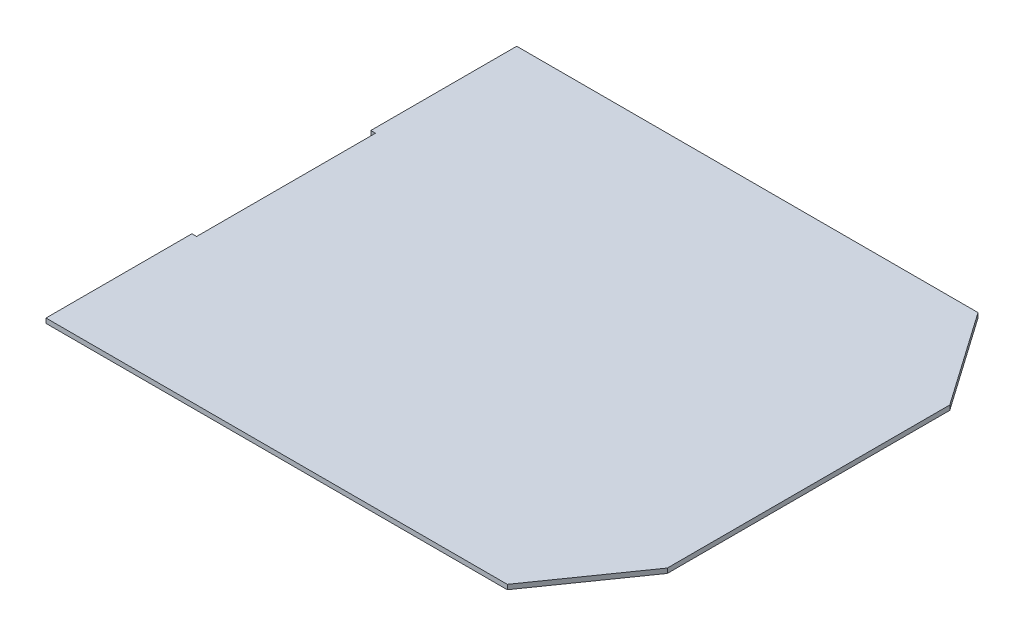
ISO-10303-21;
HEADER;
FILE_DESCRIPTION(('STEP AP214'),'2;1');
FILE_NAME('part.step','',(''),(''),'','','');
FILE_SCHEMA(('AUTOMOTIVE_DESIGN { 1 0 10303 214 1 1 1 1 }'));
ENDSEC;
DATA;
#1=APPLICATION_CONTEXT('core data for automotive mechanical design processes');
#2=APPLICATION_PROTOCOL_DEFINITION('international standard','automotive_design',2000,#1);
#3=PRODUCT_CONTEXT('',#1,'mechanical');
#4=PRODUCT('Part','Part','',(#3));
#5=PRODUCT_RELATED_PRODUCT_CATEGORY('part','',(#4));
#6=PRODUCT_DEFINITION_FORMATION('','',#4);
#7=PRODUCT_DEFINITION_CONTEXT('part definition',#1,'design');
#8=PRODUCT_DEFINITION('design','',#6,#7);
#9=PRODUCT_DEFINITION_SHAPE('','',#8);
#10=(LENGTH_UNIT() NAMED_UNIT(*) SI_UNIT(.MILLI.,.METRE.));
#11=(NAMED_UNIT(*) PLANE_ANGLE_UNIT() SI_UNIT($,.RADIAN.));
#12=(NAMED_UNIT(*) SI_UNIT($,.STERADIAN.) SOLID_ANGLE_UNIT());
#13=UNCERTAINTY_MEASURE_WITH_UNIT(LENGTH_MEASURE(1.E-05),#10,'distance_accuracy_value','');
#14=(GEOMETRIC_REPRESENTATION_CONTEXT(3) GLOBAL_UNCERTAINTY_ASSIGNED_CONTEXT((#13)) GLOBAL_UNIT_ASSIGNED_CONTEXT((#10,
#11,#12)) REPRESENTATION_CONTEXT('',''));
#15=CARTESIAN_POINT('',(0.,0.,0.));
#16=DIRECTION('',(0.,0.,1.));
#17=DIRECTION('',(1.,0.,0.));
#18=AXIS2_PLACEMENT_3D('',#15,#16,#17);
#19=CARTESIAN_POINT('',(490.,5.,0.));
#20=DIRECTION('',(0.,0.,-1.));
#21=DIRECTION('',(-1.,0.,0.));
#22=AXIS2_PLACEMENT_3D('',#19,#20,#21);
#23=PLANE('',#22);
#24=DIRECTION('',(1.,0.,0.));
#25=VECTOR('',#24,1.);
#26=CARTESIAN_POINT('',(490.,0.,0.));
#27=LINE('',#26,#25);
#28=CARTESIAN_POINT('',(0.,0.,0.));
#29=VERTEX_POINT('',#28);
#30=CARTESIAN_POINT('',(490.,0.,0.));
#31=VERTEX_POINT('',#30);
#32=EDGE_CURVE('E125',#29,#31,#27,.T.);
#33=ORIENTED_EDGE('',*,*,#32,.T.);
#34=DIRECTION('',(0.,-1.,0.));
#35=VECTOR('',#34,1.);
#36=CARTESIAN_POINT('',(490.,5.,0.));
#37=LINE('',#36,#35);
#38=CARTESIAN_POINT('',(490.,5.,0.));
#39=VERTEX_POINT('',#38);
#40=EDGE_CURVE('E11',#39,#31,#37,.T.);
#41=ORIENTED_EDGE('',*,*,#40,.F.);
#42=DIRECTION('',(1.,0.,0.));
#43=VECTOR('',#42,1.);
#44=CARTESIAN_POINT('',(490.,5.,0.));
#45=LINE('',#44,#43);
#46=CARTESIAN_POINT('',(0.,5.,0.));
#47=VERTEX_POINT('',#46);
#48=EDGE_CURVE('E143',#47,#39,#45,.T.);
#49=ORIENTED_EDGE('',*,*,#48,.F.);
#50=DIRECTION('',(0.,-1.,0.));
#51=VECTOR('',#50,1.);
#52=CARTESIAN_POINT('',(0.,5.,0.));
#53=LINE('',#52,#51);
#54=EDGE_CURVE('E121',#47,#29,#53,.T.);
#55=ORIENTED_EDGE('',*,*,#54,.T.);
#56=EDGE_LOOP('',(#33,#41,#49,#55));
#57=FACE_BOUND('',#56,.T.);
#58=ADVANCED_FACE('F17',(#57),#23,.F.);
#59=CARTESIAN_POINT('',(560.,5.,-100.));
#60=DIRECTION('',(-0.81923192051904,0.,-0.573462344363329));
#61=DIRECTION('',(-0.573462344363329,0.,0.81923192051904));
#62=AXIS2_PLACEMENT_3D('',#59,#60,#61);
#63=PLANE('',#62);
#64=DIRECTION('',(0.573462344363329,0.,-0.81923192051904));
#65=VECTOR('',#64,1.);
#66=CARTESIAN_POINT('',(560.,0.,-100.));
#67=LINE('',#66,#65);
#68=CARTESIAN_POINT('',(560.,0.,-100.));
#69=VERTEX_POINT('',#68);
#70=EDGE_CURVE('E128',#31,#69,#67,.T.);
#71=ORIENTED_EDGE('',*,*,#70,.T.);
#72=DIRECTION('',(0.,-1.,0.));
#73=VECTOR('',#72,1.);
#74=CARTESIAN_POINT('',(560.,5.,-100.));
#75=LINE('',#74,#73);
#76=CARTESIAN_POINT('',(560.,5.,-100.));
#77=VERTEX_POINT('',#76);
#78=EDGE_CURVE('E25',#77,#69,#75,.T.);
#79=ORIENTED_EDGE('',*,*,#78,.F.);
#80=DIRECTION('',(0.573462344363329,0.,-0.81923192051904));
#81=VECTOR('',#80,1.);
#82=CARTESIAN_POINT('',(560.,5.,-100.));
#83=LINE('',#82,#81);
#84=EDGE_CURVE('E82',#39,#77,#83,.T.);
#85=ORIENTED_EDGE('',*,*,#84,.F.);
#86=ORIENTED_EDGE('',*,*,#40,.T.);
#87=EDGE_LOOP('',(#71,#79,#85,#86));
#88=FACE_BOUND('',#87,.T.);
#89=ADVANCED_FACE('F192',(#88),#63,.F.);
#90=CARTESIAN_POINT('',(560.,5.,-400.));
#91=DIRECTION('',(-1.,0.,0.));
#92=DIRECTION('',(0.,0.,1.));
#93=AXIS2_PLACEMENT_3D('',#90,#91,#92);
#94=PLANE('',#93);
#95=DIRECTION('',(0.,0.,-1.));
#96=VECTOR('',#95,1.);
#97=CARTESIAN_POINT('',(560.,0.,-400.));
#98=LINE('',#97,#96);
#99=CARTESIAN_POINT('',(560.,0.,-400.));
#100=VERTEX_POINT('',#99);
#101=EDGE_CURVE('E130',#69,#100,#98,.T.);
#102=ORIENTED_EDGE('',*,*,#101,.T.);
#103=DIRECTION('',(0.,-1.,0.));
#104=VECTOR('',#103,1.);
#105=CARTESIAN_POINT('',(560.,5.,-400.));
#106=LINE('',#105,#104);
#107=CARTESIAN_POINT('',(560.,5.,-400.));
#108=VERTEX_POINT('',#107);
#109=EDGE_CURVE('E156',#108,#100,#106,.T.);
#110=ORIENTED_EDGE('',*,*,#109,.F.);
#111=DIRECTION('',(0.,0.,-1.));
#112=VECTOR('',#111,1.);
#113=CARTESIAN_POINT('',(560.,5.,-400.));
#114=LINE('',#113,#112);
#115=EDGE_CURVE('E164',#77,#108,#114,.T.);
#116=ORIENTED_EDGE('',*,*,#115,.F.);
#117=ORIENTED_EDGE('',*,*,#78,.T.);
#118=EDGE_LOOP('',(#102,#110,#116,#117));
#119=FACE_BOUND('',#118,.T.);
#120=ADVANCED_FACE('F162',(#119),#94,.F.);
#121=CARTESIAN_POINT('',(490.,5.,-500.));
#122=DIRECTION('',(-0.819231920519041,0.,0.573462344363328));
#123=DIRECTION('',(0.573462344363328,0.,0.819231920519041));
#124=AXIS2_PLACEMENT_3D('',#121,#122,#123);
#125=PLANE('',#124);
#126=DIRECTION('',(-0.573462344363328,0.,-0.819231920519041));
#127=VECTOR('',#126,1.);
#128=CARTESIAN_POINT('',(490.,0.,-500.));
#129=LINE('',#128,#127);
#130=CARTESIAN_POINT('',(490.,0.,-500.));
#131=VERTEX_POINT('',#130);
#132=EDGE_CURVE('E132',#100,#131,#129,.T.);
#133=ORIENTED_EDGE('',*,*,#132,.T.);
#134=DIRECTION('',(0.,-1.,0.));
#135=VECTOR('',#134,1.);
#136=CARTESIAN_POINT('',(490.,5.,-500.));
#137=LINE('',#136,#135);
#138=CARTESIAN_POINT('',(490.,5.,-500.));
#139=VERTEX_POINT('',#138);
#140=EDGE_CURVE('E153',#139,#131,#137,.T.);
#141=ORIENTED_EDGE('',*,*,#140,.F.);
#142=DIRECTION('',(-0.573462344363328,0.,-0.819231920519041));
#143=VECTOR('',#142,1.);
#144=CARTESIAN_POINT('',(490.,5.,-500.));
#145=LINE('',#144,#143);
#146=EDGE_CURVE('E182',#108,#139,#145,.T.);
#147=ORIENTED_EDGE('',*,*,#146,.F.);
#148=ORIENTED_EDGE('',*,*,#109,.T.);
#149=EDGE_LOOP('',(#133,#141,#147,#148));
#150=FACE_BOUND('',#149,.T.);
#151=ADVANCED_FACE('F173',(#150),#125,.F.);
#152=CARTESIAN_POINT('',(0.,5.,-500.));
#153=DIRECTION('',(0.,0.,1.));
#154=DIRECTION('',(1.,0.,0.));
#155=AXIS2_PLACEMENT_3D('',#152,#153,#154);
#156=PLANE('',#155);
#157=DIRECTION('',(-1.,0.,0.));
#158=VECTOR('',#157,1.);
#159=CARTESIAN_POINT('',(0.,0.,-500.));
#160=LINE('',#159,#158);
#161=CARTESIAN_POINT('',(0.,0.,-500.));
#162=VERTEX_POINT('',#161);
#163=EDGE_CURVE('E134',#131,#162,#160,.T.);
#164=ORIENTED_EDGE('',*,*,#163,.T.);
#165=DIRECTION('',(0.,-1.,0.));
#166=VECTOR('',#165,1.);
#167=CARTESIAN_POINT('',(0.,5.,-500.));
#168=LINE('',#167,#166);
#169=CARTESIAN_POINT('',(0.,5.,-500.));
#170=VERTEX_POINT('',#169);
#171=EDGE_CURVE('E150',#170,#162,#168,.T.);
#172=ORIENTED_EDGE('',*,*,#171,.F.);
#173=DIRECTION('',(-1.,0.,0.));
#174=VECTOR('',#173,1.);
#175=CARTESIAN_POINT('',(0.,5.,-500.));
#176=LINE('',#175,#174);
#177=EDGE_CURVE('E179',#139,#170,#176,.T.);
#178=ORIENTED_EDGE('',*,*,#177,.F.);
#179=ORIENTED_EDGE('',*,*,#140,.T.);
#180=EDGE_LOOP('',(#164,#172,#178,#179));
#181=FACE_BOUND('',#180,.T.);
#182=ADVANCED_FACE('F177',(#181),#156,.F.);
#183=CARTESIAN_POINT('',(0.,5.,-345.));
#184=DIRECTION('',(1.,0.,0.));
#185=DIRECTION('',(0.,0.,-1.));
#186=AXIS2_PLACEMENT_3D('',#183,#184,#185);
#187=PLANE('',#186);
#188=DIRECTION('',(0.,0.,1.));
#189=VECTOR('',#188,1.);
#190=CARTESIAN_POINT('',(0.,0.,-345.));
#191=LINE('',#190,#189);
#192=CARTESIAN_POINT('',(0.,0.,-345.));
#193=VERTEX_POINT('',#192);
#194=EDGE_CURVE('E136',#162,#193,#191,.T.);
#195=ORIENTED_EDGE('',*,*,#194,.T.);
#196=DIRECTION('',(0.,-1.,0.));
#197=VECTOR('',#196,1.);
#198=CARTESIAN_POINT('',(0.,5.,-345.));
#199=LINE('',#198,#197);
#200=CARTESIAN_POINT('',(0.,5.,-345.));
#201=VERTEX_POINT('',#200);
#202=EDGE_CURVE('E147',#201,#193,#199,.T.);
#203=ORIENTED_EDGE('',*,*,#202,.F.);
#204=DIRECTION('',(0.,0.,1.));
#205=VECTOR('',#204,1.);
#206=CARTESIAN_POINT('',(0.,5.,-345.));
#207=LINE('',#206,#205);
#208=EDGE_CURVE('E181',#170,#201,#207,.T.);
#209=ORIENTED_EDGE('',*,*,#208,.F.);
#210=ORIENTED_EDGE('',*,*,#171,.T.);
#211=EDGE_LOOP('',(#195,#203,#209,#210));
#212=FACE_BOUND('',#211,.T.);
#213=ADVANCED_FACE('F206',(#212),#187,.F.);
#214=CARTESIAN_POINT('',(5.,5.,-345.));
#215=DIRECTION('',(0.,0.,-1.));
#216=DIRECTION('',(-1.,0.,0.));
#217=AXIS2_PLACEMENT_3D('',#214,#215,#216);
#218=PLANE('',#217);
#219=DIRECTION('',(1.,0.,0.));
#220=VECTOR('',#219,1.);
#221=CARTESIAN_POINT('',(5.,0.,-345.));
#222=LINE('',#221,#220);
#223=CARTESIAN_POINT('',(5.,0.,-345.));
#224=VERTEX_POINT('',#223);
#225=EDGE_CURVE('E138',#193,#224,#222,.T.);
#226=ORIENTED_EDGE('',*,*,#225,.T.);
#227=DIRECTION('',(0.,-1.,0.));
#228=VECTOR('',#227,1.);
#229=CARTESIAN_POINT('',(5.,5.,-345.));
#230=LINE('',#229,#228);
#231=CARTESIAN_POINT('',(5.,5.,-345.));
#232=VERTEX_POINT('',#231);
#233=EDGE_CURVE('E116',#232,#224,#230,.T.);
#234=ORIENTED_EDGE('',*,*,#233,.F.);
#235=DIRECTION('',(1.,0.,0.));
#236=VECTOR('',#235,1.);
#237=CARTESIAN_POINT('',(5.,5.,-345.));
#238=LINE('',#237,#236);
#239=EDGE_CURVE('E107',#201,#232,#238,.T.);
#240=ORIENTED_EDGE('',*,*,#239,.F.);
#241=ORIENTED_EDGE('',*,*,#202,.T.);
#242=EDGE_LOOP('',(#226,#234,#240,#241));
#243=FACE_BOUND('',#242,.T.);
#244=ADVANCED_FACE('F209',(#243),#218,.F.);
#245=CARTESIAN_POINT('',(5.,5.,-155.));
#246=DIRECTION('',(1.,0.,0.));
#247=DIRECTION('',(0.,0.,-1.));
#248=AXIS2_PLACEMENT_3D('',#245,#246,#247);
#249=PLANE('',#248);
#250=DIRECTION('',(0.,0.,1.));
#251=VECTOR('',#250,1.);
#252=CARTESIAN_POINT('',(5.,0.,-155.));
#253=LINE('',#252,#251);
#254=CARTESIAN_POINT('',(5.,0.,-155.));
#255=VERTEX_POINT('',#254);
#256=EDGE_CURVE('E115',#224,#255,#253,.T.);
#257=ORIENTED_EDGE('',*,*,#256,.T.);
#258=DIRECTION('',(0.,-1.,0.));
#259=VECTOR('',#258,1.);
#260=CARTESIAN_POINT('',(5.,5.,-155.));
#261=LINE('',#260,#259);
#262=CARTESIAN_POINT('',(5.,5.,-155.));
#263=VERTEX_POINT('',#262);
#264=EDGE_CURVE('E112',#263,#255,#261,.T.);
#265=ORIENTED_EDGE('',*,*,#264,.F.);
#266=DIRECTION('',(0.,0.,1.));
#267=VECTOR('',#266,1.);
#268=CARTESIAN_POINT('',(5.,5.,-155.));
#269=LINE('',#268,#267);
#270=EDGE_CURVE('E101',#232,#263,#269,.T.);
#271=ORIENTED_EDGE('',*,*,#270,.F.);
#272=ORIENTED_EDGE('',*,*,#233,.T.);
#273=EDGE_LOOP('',(#257,#265,#271,#272));
#274=FACE_BOUND('',#273,.T.);
#275=ADVANCED_FACE('F113',(#274),#249,.F.);
#276=CARTESIAN_POINT('',(0.,5.,-155.));
#277=DIRECTION('',(0.,0.,1.));
#278=DIRECTION('',(1.,0.,0.));
#279=AXIS2_PLACEMENT_3D('',#276,#277,#278);
#280=PLANE('',#279);
#281=DIRECTION('',(-1.,0.,0.));
#282=VECTOR('',#281,1.);
#283=CARTESIAN_POINT('',(0.,0.,-155.));
#284=LINE('',#283,#282);
#285=CARTESIAN_POINT('',(0.,0.,-155.));
#286=VERTEX_POINT('',#285);
#287=EDGE_CURVE('E68',#255,#286,#284,.T.);
#288=ORIENTED_EDGE('',*,*,#287,.T.);
#289=DIRECTION('',(0.,-1.,0.));
#290=VECTOR('',#289,1.);
#291=CARTESIAN_POINT('',(0.,5.,-155.));
#292=LINE('',#291,#290);
#293=CARTESIAN_POINT('',(0.,5.,-155.));
#294=VERTEX_POINT('',#293);
#295=EDGE_CURVE('E117',#294,#286,#292,.T.);
#296=ORIENTED_EDGE('',*,*,#295,.F.);
#297=DIRECTION('',(-1.,0.,0.));
#298=VECTOR('',#297,1.);
#299=CARTESIAN_POINT('',(0.,5.,-155.));
#300=LINE('',#299,#298);
#301=EDGE_CURVE('E105',#263,#294,#300,.T.);
#302=ORIENTED_EDGE('',*,*,#301,.F.);
#303=ORIENTED_EDGE('',*,*,#264,.T.);
#304=EDGE_LOOP('',(#288,#296,#302,#303));
#305=FACE_BOUND('',#304,.T.);
#306=ADVANCED_FACE('F119',(#305),#280,.F.);
#307=CARTESIAN_POINT('',(0.,5.,0.));
#308=DIRECTION('',(1.,0.,0.));
#309=DIRECTION('',(0.,0.,-1.));
#310=AXIS2_PLACEMENT_3D('',#307,#308,#309);
#311=PLANE('',#310);
#312=DIRECTION('',(0.,0.,1.));
#313=VECTOR('',#312,1.);
#314=CARTESIAN_POINT('',(0.,0.,0.));
#315=LINE('',#314,#313);
#316=EDGE_CURVE('E74',#286,#29,#315,.T.);
#317=ORIENTED_EDGE('',*,*,#316,.T.);
#318=ORIENTED_EDGE('',*,*,#54,.F.);
#319=DIRECTION('',(0.,0.,1.));
#320=VECTOR('',#319,1.);
#321=CARTESIAN_POINT('',(0.,5.,0.));
#322=LINE('',#321,#320);
#323=EDGE_CURVE('E33',#294,#47,#322,.T.);
#324=ORIENTED_EDGE('',*,*,#323,.F.);
#325=ORIENTED_EDGE('',*,*,#295,.T.);
#326=EDGE_LOOP('',(#317,#318,#324,#325));
#327=FACE_BOUND('',#326,.T.);
#328=ADVANCED_FACE('F218',(#327),#311,.F.);
#329=CARTESIAN_POINT('',(0.,5.,0.));
#330=DIRECTION('',(0.,-1.,0.));
#331=DIRECTION('',(0.,0.,-1.));
#332=AXIS2_PLACEMENT_3D('',#329,#330,#331);
#333=PLANE('',#332);
#334=ORIENTED_EDGE('',*,*,#48,.T.);
#335=ORIENTED_EDGE('',*,*,#84,.T.);
#336=ORIENTED_EDGE('',*,*,#115,.T.);
#337=ORIENTED_EDGE('',*,*,#146,.T.);
#338=ORIENTED_EDGE('',*,*,#177,.T.);
#339=ORIENTED_EDGE('',*,*,#208,.T.);
#340=ORIENTED_EDGE('',*,*,#239,.T.);
#341=ORIENTED_EDGE('',*,*,#270,.T.);
#342=ORIENTED_EDGE('',*,*,#301,.T.);
#343=ORIENTED_EDGE('',*,*,#323,.T.);
#344=EDGE_LOOP('',(#334,#335,#336,#337,#338,#339,#340,#341,#342,#343));
#345=FACE_BOUND('',#344,.T.);
#346=ADVANCED_FACE('F103',(#345),#333,.F.);
#347=CARTESIAN_POINT('',(0.,0.,0.));
#348=DIRECTION('',(0.,-1.,0.));
#349=DIRECTION('',(0.,0.,-1.));
#350=AXIS2_PLACEMENT_3D('',#347,#348,#349);
#351=PLANE('',#350);
#352=ORIENTED_EDGE('',*,*,#32,.F.);
#353=ORIENTED_EDGE('',*,*,#316,.F.);
#354=ORIENTED_EDGE('',*,*,#287,.F.);
#355=ORIENTED_EDGE('',*,*,#256,.F.);
#356=ORIENTED_EDGE('',*,*,#225,.F.);
#357=ORIENTED_EDGE('',*,*,#194,.F.);
#358=ORIENTED_EDGE('',*,*,#163,.F.);
#359=ORIENTED_EDGE('',*,*,#132,.F.);
#360=ORIENTED_EDGE('',*,*,#101,.F.);
#361=ORIENTED_EDGE('',*,*,#70,.F.);
#362=EDGE_LOOP('',(#352,#353,#354,#355,#356,#357,#358,#359,#360,#361));
#363=FACE_BOUND('',#362,.T.);
#364=ADVANCED_FACE('F168',(#363),#351,.T.);
#365=CLOSED_SHELL('',(#58,#89,#120,#151,#182,#213,#244,#275,#306,#328,#346,#364));
#366=MANIFOLD_SOLID_BREP('B1',#365);
#367=ADVANCED_BREP_SHAPE_REPRESENTATION('',(#18,#366),#14);
#368=SHAPE_DEFINITION_REPRESENTATION(#9,#367);
ENDSEC;
END-ISO-10303-21;
